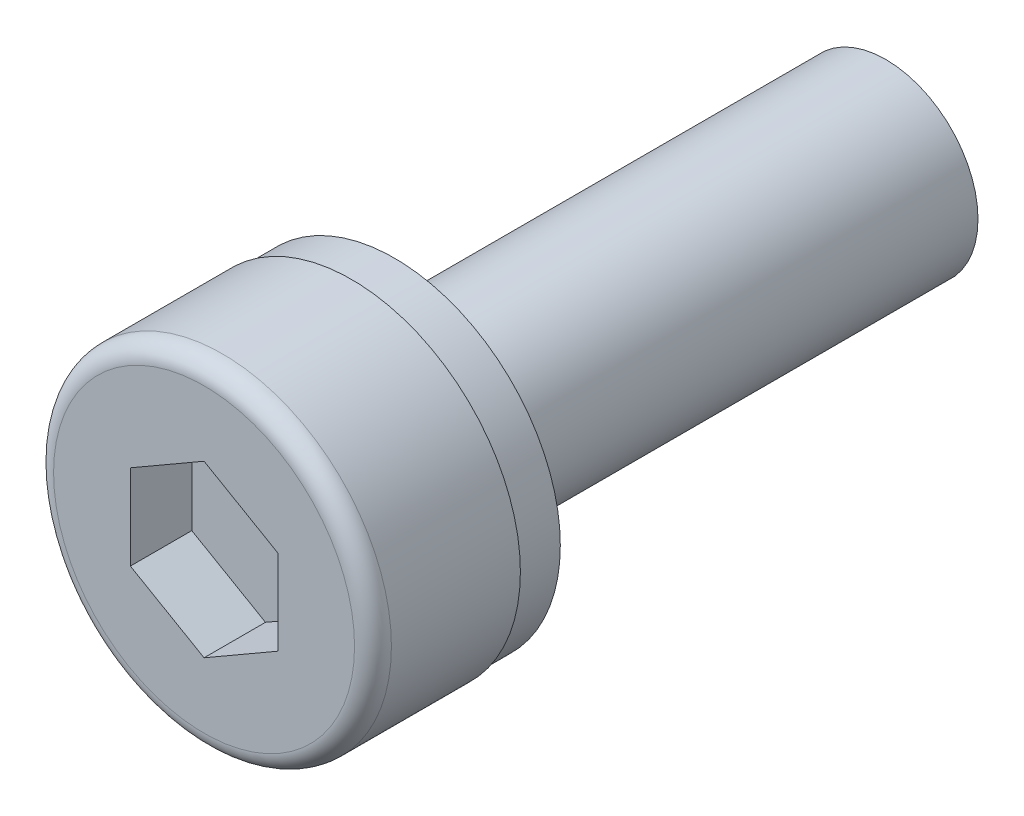
ISO-10303-21;
HEADER;
FILE_DESCRIPTION(('STEP AP214'),'2;1');
FILE_NAME('part.step','',(''),(''),'','','');
FILE_SCHEMA(('AUTOMOTIVE_DESIGN { 1 0 10303 214 1 1 1 1 }'));
ENDSEC;
DATA;
#1=APPLICATION_CONTEXT('core data for automotive mechanical design processes');
#2=APPLICATION_PROTOCOL_DEFINITION('international standard','automotive_design',2000,#1);
#3=PRODUCT_CONTEXT('',#1,'mechanical');
#4=PRODUCT('Part','Part','',(#3));
#5=PRODUCT_RELATED_PRODUCT_CATEGORY('part','',(#4));
#6=PRODUCT_DEFINITION_FORMATION('','',#4);
#7=PRODUCT_DEFINITION_CONTEXT('part definition',#1,'design');
#8=PRODUCT_DEFINITION('design','',#6,#7);
#9=PRODUCT_DEFINITION_SHAPE('','',#8);
#10=(LENGTH_UNIT() NAMED_UNIT(*) SI_UNIT(.MILLI.,.METRE.));
#11=(NAMED_UNIT(*) PLANE_ANGLE_UNIT() SI_UNIT($,.RADIAN.));
#12=(NAMED_UNIT(*) SI_UNIT($,.STERADIAN.) SOLID_ANGLE_UNIT());
#13=UNCERTAINTY_MEASURE_WITH_UNIT(LENGTH_MEASURE(1.E-05),#10,'distance_accuracy_value','');
#14=(GEOMETRIC_REPRESENTATION_CONTEXT(3) GLOBAL_UNCERTAINTY_ASSIGNED_CONTEXT((#13)) GLOBAL_UNIT_ASSIGNED_CONTEXT((#10,
#11,#12)) REPRESENTATION_CONTEXT('',''));
#15=CARTESIAN_POINT('',(0.,0.,0.));
#16=DIRECTION('',(0.,0.,1.));
#17=DIRECTION('',(1.,0.,0.));
#18=AXIS2_PLACEMENT_3D('',#15,#16,#17);
#19=CARTESIAN_POINT('',(0.,0.,0.));
#20=DIRECTION('',(0.,0.,-1.));
#21=DIRECTION('',(1.,0.,0.));
#22=AXIS2_PLACEMENT_3D('',#19,#20,#21);
#23=CYLINDRICAL_SURFACE('',#22,1.5);
#24=CARTESIAN_POINT('',(0.,0.,-8.));
#25=DIRECTION('',(0.,0.,-1.));
#26=DIRECTION('',(1.,0.,0.));
#27=AXIS2_PLACEMENT_3D('',#24,#25,#26);
#28=CIRCLE('',#27,1.5);
#29=CARTESIAN_POINT('',(-1.5,0.,-8.));
#30=VERTEX_POINT('',#29);
#31=EDGE_CURVE('E28',#30,#30,#28,.T.);
#32=ORIENTED_EDGE('',*,*,#31,.F.);
#33=DIRECTION('',(0.,0.,1.));
#34=VECTOR('',#33,1.);
#35=CARTESIAN_POINT('',(-1.5,0.,0.));
#36=LINE('',#35,#34);
#37=CARTESIAN_POINT('',(-1.5,0.,0.));
#38=VERTEX_POINT('',#37);
#39=EDGE_CURVE('E11',#30,#38,#36,.T.);
#40=ORIENTED_EDGE('',*,*,#39,.T.);
#41=CARTESIAN_POINT('',(0.,0.,0.));
#42=DIRECTION('',(0.,0.,1.));
#43=DIRECTION('',(1.,0.,0.));
#44=AXIS2_PLACEMENT_3D('',#41,#42,#43);
#45=CIRCLE('',#44,1.5);
#46=EDGE_CURVE('E156',#38,#38,#45,.T.);
#47=ORIENTED_EDGE('',*,*,#46,.F.);
#48=ORIENTED_EDGE('',*,*,#39,.F.);
#49=EDGE_LOOP('',(#32,#40,#47,#48));
#50=FACE_BOUND('',#49,.T.);
#51=ADVANCED_FACE('F17',(#50),#23,.T.);
#52=CARTESIAN_POINT('',(0.,0.,-8.));
#53=DIRECTION('',(0.,0.,-1.));
#54=DIRECTION('',(0.,-1.,0.));
#55=AXIS2_PLACEMENT_3D('',#52,#53,#54);
#56=PLANE('',#55);
#57=ORIENTED_EDGE('',*,*,#31,.T.);
#58=EDGE_LOOP('',(#57));
#59=FACE_BOUND('',#58,.T.);
#60=ADVANCED_FACE('F212',(#59),#56,.T.);
#61=CARTESIAN_POINT('',(0.,0.,0.));
#62=DIRECTION('',(0.,0.,1.));
#63=DIRECTION('',(1.,0.,0.));
#64=AXIS2_PLACEMENT_3D('',#61,#62,#63);
#65=PLANE('',#64);
#66=ORIENTED_EDGE('',*,*,#46,.T.);
#67=EDGE_LOOP('',(#66));
#68=FACE_BOUND('',#67,.T.);
#69=CARTESIAN_POINT('',(0.,0.,0.));
#70=DIRECTION('',(0.,0.,-1.));
#71=DIRECTION('',(1.,0.,0.));
#72=AXIS2_PLACEMENT_3D('',#69,#70,#71);
#73=CIRCLE('',#72,2.6999999396503);
#74=CARTESIAN_POINT('',(-2.6999999396503,0.,0.));
#75=VERTEX_POINT('',#74);
#76=EDGE_CURVE('E221',#75,#75,#73,.T.);
#77=ORIENTED_EDGE('',*,*,#76,.T.);
#78=EDGE_LOOP('',(#77));
#79=FACE_BOUND('',#78,.T.);
#80=ADVANCED_FACE('F214',(#68,#79),#65,.F.);
#81=CARTESIAN_POINT('',(0.,0.,2.1));
#82=DIRECTION('',(0.,0.,-1.));
#83=DIRECTION('',(0.,-1.,0.));
#84=AXIS2_PLACEMENT_3D('',#81,#82,#83);
#85=PLANE('',#84);
#86=DIRECTION('',(0.,-1.,0.));
#87=VECTOR('',#86,1.);
#88=CARTESIAN_POINT('',(1.19999997317791,-0.692820307541811,2.1));
#89=LINE('',#88,#87);
#90=CARTESIAN_POINT('',(1.19999997317791,0.69282030754181,2.1));
#91=VERTEX_POINT('',#90);
#92=CARTESIAN_POINT('',(1.19999997317791,-0.692820307541811,2.1));
#93=VERTEX_POINT('',#92);
#94=EDGE_CURVE('E153',#91,#93,#89,.T.);
#95=ORIENTED_EDGE('',*,*,#94,.F.);
#96=DIRECTION('',(0.866025403784439,-0.5,0.));
#97=VECTOR('',#96,1.);
#98=CARTESIAN_POINT('',(1.19999997317791,0.69282030754181,2.1));
#99=LINE('',#98,#97);
#100=CARTESIAN_POINT('',(0.,1.38564061508362,2.1));
#101=VERTEX_POINT('',#100);
#102=EDGE_CURVE('E120',#101,#91,#99,.T.);
#103=ORIENTED_EDGE('',*,*,#102,.F.);
#104=DIRECTION('',(0.866025403784439,0.5,0.));
#105=VECTOR('',#104,1.);
#106=CARTESIAN_POINT('',(0.,1.38564061508362,2.1));
#107=LINE('',#106,#105);
#108=CARTESIAN_POINT('',(-1.19999997317791,0.69282030754181,2.1));
#109=VERTEX_POINT('',#108);
#110=EDGE_CURVE('E114',#109,#101,#107,.T.);
#111=ORIENTED_EDGE('',*,*,#110,.F.);
#112=DIRECTION('',(0.,1.,0.));
#113=VECTOR('',#112,1.);
#114=CARTESIAN_POINT('',(-1.19999997317791,0.69282030754181,2.1));
#115=LINE('',#114,#113);
#116=CARTESIAN_POINT('',(-1.19999997317791,-0.692820307541809,2.1));
#117=VERTEX_POINT('',#116);
#118=EDGE_CURVE('E171',#117,#109,#115,.T.);
#119=ORIENTED_EDGE('',*,*,#118,.F.);
#120=DIRECTION('',(-0.866025403784439,0.5,0.));
#121=VECTOR('',#120,1.);
#122=CARTESIAN_POINT('',(-1.19999997317791,-0.692820307541809,2.1));
#123=LINE('',#122,#121);
#124=CARTESIAN_POINT('',(0.,-1.38564061508362,2.1));
#125=VERTEX_POINT('',#124);
#126=EDGE_CURVE('E151',#125,#117,#123,.T.);
#127=ORIENTED_EDGE('',*,*,#126,.F.);
#128=DIRECTION('',(-0.866025403784439,-0.5,0.));
#129=VECTOR('',#128,1.);
#130=CARTESIAN_POINT('',(0.,-1.38564061508362,2.1));
#131=LINE('',#130,#129);
#132=EDGE_CURVE('E157',#93,#125,#131,.T.);
#133=ORIENTED_EDGE('',*,*,#132,.F.);
#134=EDGE_LOOP('',(#95,#103,#111,#119,#127,#133));
#135=FACE_BOUND('',#134,.T.);
#136=ADVANCED_FACE('F217',(#135),#85,.F.);
#137=CARTESIAN_POINT('',(1.19999997317791,0.69282030754181,3.1));
#138=DIRECTION('',(1.,0.,0.));
#139=DIRECTION('',(0.,-1.,0.));
#140=AXIS2_PLACEMENT_3D('',#137,#138,#139);
#141=PLANE('',#140);
#142=DIRECTION('',(0.,-1.,0.));
#143=VECTOR('',#142,1.);
#144=CARTESIAN_POINT('',(1.19999997317791,0.346410153770905,3.1));
#145=LINE('',#144,#143);
#146=CARTESIAN_POINT('',(1.19999997317791,0.69282030754181,3.1));
#147=VERTEX_POINT('',#146);
#148=CARTESIAN_POINT('',(1.19999997317791,-0.692820307541811,3.1));
#149=VERTEX_POINT('',#148);
#150=EDGE_CURVE('E136',#147,#149,#145,.T.);
#151=ORIENTED_EDGE('',*,*,#150,.F.);
#152=DIRECTION('',(0.,0.,-1.));
#153=VECTOR('',#152,1.);
#154=CARTESIAN_POINT('',(1.19999997317791,0.69282030754181,3.1));
#155=LINE('',#154,#153);
#156=EDGE_CURVE('E133',#147,#91,#155,.T.);
#157=ORIENTED_EDGE('',*,*,#156,.T.);
#158=ORIENTED_EDGE('',*,*,#94,.T.);
#159=DIRECTION('',(0.,0.,-1.));
#160=VECTOR('',#159,1.);
#161=CARTESIAN_POINT('',(1.19999997317791,-0.692820307541811,3.1));
#162=LINE('',#161,#160);
#163=EDGE_CURVE('E182',#149,#93,#162,.T.);
#164=ORIENTED_EDGE('',*,*,#163,.F.);
#165=EDGE_LOOP('',(#151,#157,#158,#164));
#166=FACE_BOUND('',#165,.T.);
#167=ADVANCED_FACE('F281',(#166),#141,.F.);
#168=CARTESIAN_POINT('',(1.19999997317791,-0.692820307541811,3.1));
#169=DIRECTION('',(0.5,-0.866025403784439,0.));
#170=DIRECTION('',(0.,0.,-1.));
#171=AXIS2_PLACEMENT_3D('',#168,#169,#170);
#172=PLANE('',#171);
#173=DIRECTION('',(-0.866025403784439,-0.5,0.));
#174=VECTOR('',#173,1.);
#175=CARTESIAN_POINT('',(0.899999979883432,-0.866025384427263,3.1));
#176=LINE('',#175,#174);
#177=CARTESIAN_POINT('',(0.,-1.38564061508362,3.1));
#178=VERTEX_POINT('',#177);
#179=EDGE_CURVE('E144',#149,#178,#176,.T.);
#180=ORIENTED_EDGE('',*,*,#179,.F.);
#181=ORIENTED_EDGE('',*,*,#163,.T.);
#182=ORIENTED_EDGE('',*,*,#132,.T.);
#183=DIRECTION('',(0.,0.,-1.));
#184=VECTOR('',#183,1.);
#185=CARTESIAN_POINT('',(0.,-1.38564061508362,3.1));
#186=LINE('',#185,#184);
#187=EDGE_CURVE('E174',#178,#125,#186,.T.);
#188=ORIENTED_EDGE('',*,*,#187,.F.);
#189=EDGE_LOOP('',(#180,#181,#182,#188));
#190=FACE_BOUND('',#189,.T.);
#191=ADVANCED_FACE('F280',(#190),#172,.F.);
#192=CARTESIAN_POINT('',(0.,-1.38564061508362,3.1));
#193=DIRECTION('',(-0.5,-0.866025403784438,0.));
#194=DIRECTION('',(-0.866025403784438,0.5,0.));
#195=AXIS2_PLACEMENT_3D('',#192,#193,#194);
#196=PLANE('',#195);
#197=DIRECTION('',(-0.866025403784439,0.5,0.));
#198=VECTOR('',#197,1.);
#199=CARTESIAN_POINT('',(-0.299999993294478,-1.21243553819817,3.1));
#200=LINE('',#199,#198);
#201=CARTESIAN_POINT('',(-1.19999997317791,-0.692820307541809,3.1));
#202=VERTEX_POINT('',#201);
#203=EDGE_CURVE('E168',#178,#202,#200,.T.);
#204=ORIENTED_EDGE('',*,*,#203,.F.);
#205=ORIENTED_EDGE('',*,*,#187,.T.);
#206=ORIENTED_EDGE('',*,*,#126,.T.);
#207=DIRECTION('',(0.,0.,-1.));
#208=VECTOR('',#207,1.);
#209=CARTESIAN_POINT('',(-1.19999997317791,-0.692820307541809,3.1));
#210=LINE('',#209,#208);
#211=EDGE_CURVE('E166',#202,#117,#210,.T.);
#212=ORIENTED_EDGE('',*,*,#211,.F.);
#213=EDGE_LOOP('',(#204,#205,#206,#212));
#214=FACE_BOUND('',#213,.T.);
#215=ADVANCED_FACE('F288',(#214),#196,.F.);
#216=CARTESIAN_POINT('',(-1.19999997317791,-0.692820307541809,3.1));
#217=DIRECTION('',(-1.,0.,0.));
#218=DIRECTION('',(0.,0.,1.));
#219=AXIS2_PLACEMENT_3D('',#216,#217,#218);
#220=PLANE('',#219);
#221=DIRECTION('',(0.,1.,0.));
#222=VECTOR('',#221,1.);
#223=CARTESIAN_POINT('',(-1.19999997317791,-0.346410153770904,3.1));
#224=LINE('',#223,#222);
#225=CARTESIAN_POINT('',(-1.19999997317791,0.69282030754181,3.1));
#226=VERTEX_POINT('',#225);
#227=EDGE_CURVE('E129',#202,#226,#224,.T.);
#228=ORIENTED_EDGE('',*,*,#227,.F.);
#229=ORIENTED_EDGE('',*,*,#211,.T.);
#230=ORIENTED_EDGE('',*,*,#118,.T.);
#231=DIRECTION('',(0.,0.,-1.));
#232=VECTOR('',#231,1.);
#233=CARTESIAN_POINT('',(-1.19999997317791,0.69282030754181,3.1));
#234=LINE('',#233,#232);
#235=EDGE_CURVE('E167',#226,#109,#234,.T.);
#236=ORIENTED_EDGE('',*,*,#235,.F.);
#237=EDGE_LOOP('',(#228,#229,#230,#236));
#238=FACE_BOUND('',#237,.T.);
#239=ADVANCED_FACE('F300',(#238),#220,.F.);
#240=CARTESIAN_POINT('',(-1.19999997317791,0.69282030754181,3.1));
#241=DIRECTION('',(-0.5,0.866025403784439,0.));
#242=DIRECTION('',(0.,0.,1.));
#243=AXIS2_PLACEMENT_3D('',#240,#241,#242);
#244=PLANE('',#243);
#245=DIRECTION('',(0.866025403784439,0.5,0.));
#246=VECTOR('',#245,1.);
#247=CARTESIAN_POINT('',(-0.899999979883432,0.866025384427263,3.1));
#248=LINE('',#247,#246);
#249=CARTESIAN_POINT('',(0.,1.38564061508362,3.1));
#250=VERTEX_POINT('',#249);
#251=EDGE_CURVE('E111',#226,#250,#248,.T.);
#252=ORIENTED_EDGE('',*,*,#251,.F.);
#253=ORIENTED_EDGE('',*,*,#235,.T.);
#254=ORIENTED_EDGE('',*,*,#110,.T.);
#255=DIRECTION('',(0.,0.,-1.));
#256=VECTOR('',#255,1.);
#257=CARTESIAN_POINT('',(0.,1.38564061508362,3.1));
#258=LINE('',#257,#256);
#259=EDGE_CURVE('E21',#250,#101,#258,.T.);
#260=ORIENTED_EDGE('',*,*,#259,.F.);
#261=EDGE_LOOP('',(#252,#253,#254,#260));
#262=FACE_BOUND('',#261,.T.);
#263=ADVANCED_FACE('F109',(#262),#244,.F.);
#264=CARTESIAN_POINT('',(0.,1.38564061508362,3.1));
#265=DIRECTION('',(0.5,0.866025403784439,0.));
#266=DIRECTION('',(0.,0.,-1.));
#267=AXIS2_PLACEMENT_3D('',#264,#265,#266);
#268=PLANE('',#267);
#269=DIRECTION('',(0.866025403784439,-0.5,0.));
#270=VECTOR('',#269,1.);
#271=CARTESIAN_POINT('',(0.299999993294478,1.21243553819817,3.1));
#272=LINE('',#271,#270);
#273=EDGE_CURVE('E126',#250,#147,#272,.T.);
#274=ORIENTED_EDGE('',*,*,#273,.F.);
#275=ORIENTED_EDGE('',*,*,#259,.T.);
#276=ORIENTED_EDGE('',*,*,#102,.T.);
#277=ORIENTED_EDGE('',*,*,#156,.F.);
#278=EDGE_LOOP('',(#274,#275,#276,#277));
#279=FACE_BOUND('',#278,.T.);
#280=ADVANCED_FACE('F131',(#279),#268,.F.);
#281=CARTESIAN_POINT('',(0.,0.,3.1));
#282=DIRECTION('',(0.,0.,1.));
#283=DIRECTION('',(1.,0.,0.));
#284=AXIS2_PLACEMENT_3D('',#281,#282,#283);
#285=PLANE('',#284);
#286=ORIENTED_EDGE('',*,*,#273,.T.);
#287=ORIENTED_EDGE('',*,*,#150,.T.);
#288=ORIENTED_EDGE('',*,*,#179,.T.);
#289=ORIENTED_EDGE('',*,*,#203,.T.);
#290=ORIENTED_EDGE('',*,*,#227,.T.);
#291=ORIENTED_EDGE('',*,*,#251,.T.);
#292=EDGE_LOOP('',(#286,#287,#288,#289,#290,#291));
#293=FACE_BOUND('',#292,.T.);
#294=CARTESIAN_POINT('',(0.,0.,3.1));
#295=DIRECTION('',(0.,0.,-1.));
#296=DIRECTION('',(-1.,0.,0.));
#297=AXIS2_PLACEMENT_3D('',#294,#295,#296);
#298=CIRCLE('',#297,2.45);
#299=CARTESIAN_POINT('',(-2.45,0.,3.1));
#300=VERTEX_POINT('',#299);
#301=EDGE_CURVE('E158',#300,#300,#298,.T.);
#302=ORIENTED_EDGE('',*,*,#301,.F.);
#303=EDGE_LOOP('',(#302));
#304=FACE_BOUND('',#303,.T.);
#305=ADVANCED_FACE('F123',(#293,#304),#285,.T.);
#306=CARTESIAN_POINT('',(0.,0.,0.));
#307=DIRECTION('',(0.,0.,1.));
#308=DIRECTION('',(-1.,0.,0.));
#309=AXIS2_PLACEMENT_3D('',#306,#307,#308);
#310=CYLINDRICAL_SURFACE('',#309,2.75);
#311=CARTESIAN_POINT('',(0.,0.,2.8));
#312=DIRECTION('',(0.,0.,1.));
#313=DIRECTION('',(-1.,0.,0.));
#314=AXIS2_PLACEMENT_3D('',#311,#312,#313);
#315=CIRCLE('',#314,2.75);
#316=CARTESIAN_POINT('',(2.75,0.,2.8));
#317=VERTEX_POINT('',#316);
#318=CARTESIAN_POINT('',(-2.75,0.,2.8));
#319=VERTEX_POINT('',#318);
#320=EDGE_CURVE('E147',#317,#319,#315,.T.);
#321=ORIENTED_EDGE('',*,*,#320,.F.);
#322=DIRECTION('',(0.,0.,-1.));
#323=VECTOR('',#322,1.);
#324=CARTESIAN_POINT('',(2.75,0.,0.));
#325=LINE('',#324,#323);
#326=CARTESIAN_POINT('',(2.75,0.,0.7));
#327=VERTEX_POINT('',#326);
#328=EDGE_CURVE('E137',#317,#327,#325,.T.);
#329=ORIENTED_EDGE('',*,*,#328,.T.);
#330=CARTESIAN_POINT('',(0.,0.,0.7));
#331=DIRECTION('',(0.,0.,1.));
#332=DIRECTION('',(-1.,0.,0.));
#333=AXIS2_PLACEMENT_3D('',#330,#331,#332);
#334=CIRCLE('',#333,2.75);
#335=EDGE_CURVE('E163',#327,#327,#334,.T.);
#336=ORIENTED_EDGE('',*,*,#335,.T.);
#337=ORIENTED_EDGE('',*,*,#328,.F.);
#338=CARTESIAN_POINT('',(0.,0.,2.8));
#339=DIRECTION('',(0.,0.,1.));
#340=DIRECTION('',(-1.,0.,0.));
#341=AXIS2_PLACEMENT_3D('',#338,#339,#340);
#342=CIRCLE('',#341,2.75);
#343=EDGE_CURVE('E199',#319,#317,#342,.T.);
#344=ORIENTED_EDGE('',*,*,#343,.F.);
#345=EDGE_LOOP('',(#321,#329,#336,#337,#344));
#346=FACE_BOUND('',#345,.T.);
#347=ADVANCED_FACE('F256',(#346),#310,.T.);
#348=CARTESIAN_POINT('',(0.,0.,2.8));
#349=DIRECTION('',(0.,0.,1.));
#350=DIRECTION('',(1.,0.,0.));
#351=AXIS2_PLACEMENT_3D('',#348,#349,#350);
#352=TOROIDAL_SURFACE('',#351,2.45,0.3);
#353=ORIENTED_EDGE('',*,*,#301,.T.);
#354=CARTESIAN_POINT('',(-2.45,0.,2.8));
#355=DIRECTION('',(0.,-1.,0.));
#356=DIRECTION('',(-1.,0.,0.));
#357=AXIS2_PLACEMENT_3D('',#354,#355,#356);
#358=CIRCLE('',#357,0.3);
#359=EDGE_CURVE('E162',#300,#319,#358,.T.);
#360=ORIENTED_EDGE('',*,*,#359,.T.);
#361=ORIENTED_EDGE('',*,*,#343,.T.);
#362=ORIENTED_EDGE('',*,*,#320,.T.);
#363=ORIENTED_EDGE('',*,*,#359,.F.);
#364=EDGE_LOOP('',(#353,#360,#361,#362,#363));
#365=FACE_BOUND('',#364,.T.);
#366=ADVANCED_FACE('F250',(#365),#352,.T.);
#367=CARTESIAN_POINT('',(0.,0.,0.7));
#368=DIRECTION('',(0.,0.,-1.));
#369=DIRECTION('',(0.,-1.,0.));
#370=AXIS2_PLACEMENT_3D('',#367,#368,#369);
#371=PLANE('',#370);
#372=CARTESIAN_POINT('',(0.,0.,0.7));
#373=DIRECTION('',(0.,0.,-1.));
#374=DIRECTION('',(1.,0.,0.));
#375=AXIS2_PLACEMENT_3D('',#372,#373,#374);
#376=CIRCLE('',#375,2.6999999396503);
#377=CARTESIAN_POINT('',(-2.6999999396503,0.,0.7));
#378=VERTEX_POINT('',#377);
#379=EDGE_CURVE('E229',#378,#378,#376,.T.);
#380=ORIENTED_EDGE('',*,*,#379,.F.);
#381=EDGE_LOOP('',(#380));
#382=FACE_BOUND('',#381,.T.);
#383=ORIENTED_EDGE('',*,*,#335,.F.);
#384=EDGE_LOOP('',(#383));
#385=FACE_BOUND('',#384,.T.);
#386=ADVANCED_FACE('F247',(#382,#385),#371,.T.);
#387=CARTESIAN_POINT('',(0.,0.,0.));
#388=DIRECTION('',(0.,0.,1.));
#389=DIRECTION('',(1.,0.,0.));
#390=AXIS2_PLACEMENT_3D('',#387,#388,#389);
#391=CYLINDRICAL_SURFACE('',#390,2.6999999396503);
#392=ORIENTED_EDGE('',*,*,#76,.F.);
#393=DIRECTION('',(0.,0.,1.));
#394=VECTOR('',#393,1.);
#395=CARTESIAN_POINT('',(-2.6999999396503,0.,0.));
#396=LINE('',#395,#394);
#397=EDGE_CURVE('E195',#75,#378,#396,.T.);
#398=ORIENTED_EDGE('',*,*,#397,.T.);
#399=ORIENTED_EDGE('',*,*,#379,.T.);
#400=ORIENTED_EDGE('',*,*,#397,.F.);
#401=EDGE_LOOP('',(#392,#398,#399,#400));
#402=FACE_BOUND('',#401,.T.);
#403=ADVANCED_FACE('F19',(#402),#391,.T.);
#404=CLOSED_SHELL('',(#51,#60,#80,#136,#167,#191,#215,#239,#263,#280,#305,#347,#366,#386,#403));
#405=MANIFOLD_SOLID_BREP('B1',#404);
#406=ADVANCED_BREP_SHAPE_REPRESENTATION('',(#18,#405),#14);
#407=SHAPE_DEFINITION_REPRESENTATION(#9,#406);
ENDSEC;
END-ISO-10303-21;
